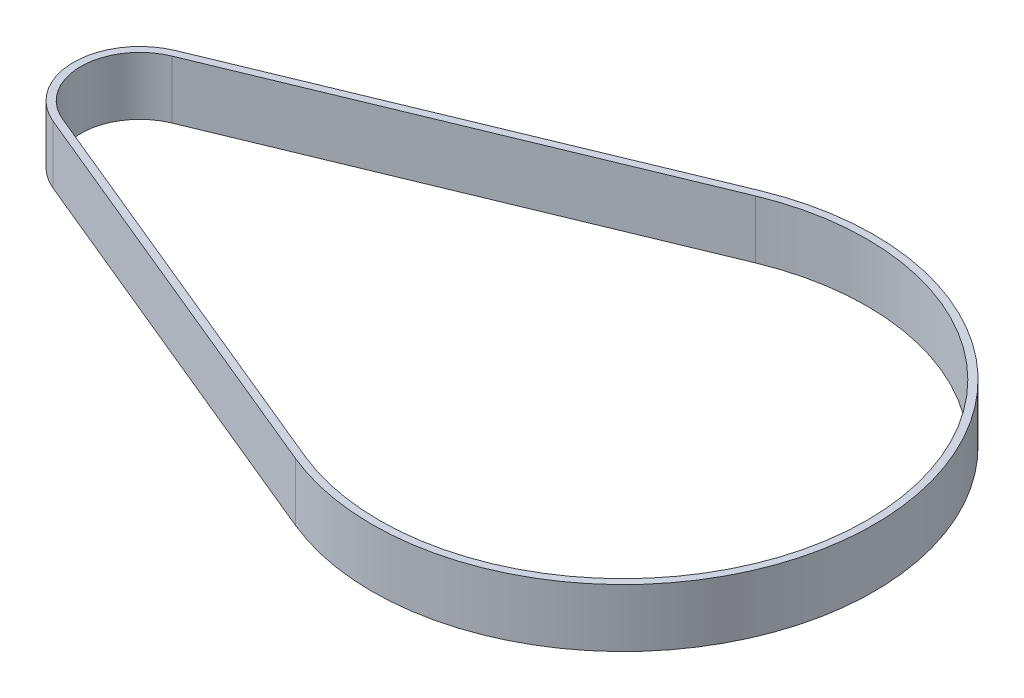
ISO-10303-21;
HEADER;
FILE_DESCRIPTION(('STEP AP214'),'2;1');
FILE_NAME('part.step','',(''),(''),'','','');
FILE_SCHEMA(('AUTOMOTIVE_DESIGN { 1 0 10303 214 1 1 1 1 }'));
ENDSEC;
DATA;
#1=APPLICATION_CONTEXT('core data for automotive mechanical design processes');
#2=APPLICATION_PROTOCOL_DEFINITION('international standard','automotive_design',2000,#1);
#3=PRODUCT_CONTEXT('',#1,'mechanical');
#4=PRODUCT('Part','Part','',(#3));
#5=PRODUCT_RELATED_PRODUCT_CATEGORY('part','',(#4));
#6=PRODUCT_DEFINITION_FORMATION('','',#4);
#7=PRODUCT_DEFINITION_CONTEXT('part definition',#1,'design');
#8=PRODUCT_DEFINITION('design','',#6,#7);
#9=PRODUCT_DEFINITION_SHAPE('','',#8);
#10=(LENGTH_UNIT() NAMED_UNIT(*) SI_UNIT(.MILLI.,.METRE.));
#11=(NAMED_UNIT(*) PLANE_ANGLE_UNIT() SI_UNIT($,.RADIAN.));
#12=(NAMED_UNIT(*) SI_UNIT($,.STERADIAN.) SOLID_ANGLE_UNIT());
#13=UNCERTAINTY_MEASURE_WITH_UNIT(LENGTH_MEASURE(1.E-05),#10,'distance_accuracy_value','');
#14=(GEOMETRIC_REPRESENTATION_CONTEXT(3) GLOBAL_UNCERTAINTY_ASSIGNED_CONTEXT((#13)) GLOBAL_UNIT_ASSIGNED_CONTEXT((#10,
#11,#12)) REPRESENTATION_CONTEXT('',''));
#15=CARTESIAN_POINT('',(0.,0.,0.));
#16=DIRECTION('',(0.,0.,1.));
#17=DIRECTION('',(1.,0.,0.));
#18=AXIS2_PLACEMENT_3D('',#15,#16,#17);
#19=CARTESIAN_POINT('',(20.4845155415814,1.62832630382703,49.5576759839291));
#20=DIRECTION('',(-0.381999745813539,0.,-0.924162428471528));
#21=DIRECTION('',(-0.924162428471528,0.,0.381999745813539));
#22=AXIS2_PLACEMENT_3D('',#19,#20,#21);
#23=PLANE('',#22);
#24=DIRECTION('',(-0.924162428471528,0.,0.381999745813539));
#25=VECTOR('',#24,1.);
#26=CARTESIAN_POINT('',(20.4845155415814,7.62832630382703,49.5576759839291));
#27=LINE('',#26,#25);
#28=CARTESIAN_POINT('',(81.9235839867051,7.62832630382713,24.162022789204));
#29=VERTEX_POINT('',#28);
#30=CARTESIAN_POINT('',(39.1962228672542,7.62832630382706,41.8232483314588));
#31=VERTEX_POINT('',#30);
#32=EDGE_CURVE('E140',#29,#31,#27,.T.);
#33=ORIENTED_EDGE('',*,*,#32,.F.);
#34=DIRECTION('',(0.,1.,0.));
#35=VECTOR('',#34,1.);
#36=CARTESIAN_POINT('',(81.9235839867051,1.62832630382713,24.162022789204));
#37=LINE('',#36,#35);
#38=CARTESIAN_POINT('',(81.9235839867051,1.62832630382713,24.162022789204));
#39=VERTEX_POINT('',#38);
#40=EDGE_CURVE('E11',#39,#29,#37,.T.);
#41=ORIENTED_EDGE('',*,*,#40,.F.);
#42=DIRECTION('',(-0.924162428471528,0.,0.381999745813539));
#43=VECTOR('',#42,1.);
#44=CARTESIAN_POINT('',(20.4845155415814,1.62832630382703,49.5576759839291));
#45=LINE('',#44,#43);
#46=CARTESIAN_POINT('',(39.1962228672542,1.62832630382706,41.8232483314588));
#47=VERTEX_POINT('',#46);
#48=EDGE_CURVE('E111',#39,#47,#45,.T.);
#49=ORIENTED_EDGE('',*,*,#48,.T.);
#50=DIRECTION('',(0.,1.,0.));
#51=VECTOR('',#50,1.);
#52=CARTESIAN_POINT('',(39.1962228672542,1.62832630382706,41.8232483314588));
#53=LINE('',#52,#51);
#54=EDGE_CURVE('E85',#47,#31,#53,.T.);
#55=ORIENTED_EDGE('',*,*,#54,.T.);
#56=EDGE_LOOP('',(#33,#41,#49,#55));
#57=FACE_BOUND('',#56,.T.);
#58=ADVANCED_FACE('F32',(#57),#23,.T.);
#59=CARTESIAN_POINT('',(91.8165498268542,1.62832630382704,48.1630816592964));
#60=DIRECTION('',(0.,1.,0.));
#61=DIRECTION('',(0.,0.,1.));
#62=AXIS2_PLACEMENT_3D('',#59,#60,#61);
#63=CYLINDRICAL_SURFACE('',#62,25.96);
#64=CARTESIAN_POINT('',(91.8165498268542,7.62832630382704,48.1630816592964));
#65=DIRECTION('',(0.,-1.,0.));
#66=DIRECTION('',(0.,0.,-1.));
#67=AXIS2_PLACEMENT_3D('',#64,#65,#66);
#68=CIRCLE('',#67,25.96);
#69=CARTESIAN_POINT('',(81.9235839867109,7.62832630382695,72.1641405293912));
#70=VERTEX_POINT('',#69);
#71=EDGE_CURVE('E117',#29,#70,#68,.T.);
#72=ORIENTED_EDGE('',*,*,#71,.T.);
#73=DIRECTION('',(0.,1.,0.));
#74=VECTOR('',#73,1.);
#75=CARTESIAN_POINT('',(81.9235839867109,1.62832630382695,72.1641405293912));
#76=LINE('',#75,#74);
#77=CARTESIAN_POINT('',(81.9235839867109,1.62832630382695,72.1641405293912));
#78=VERTEX_POINT('',#77);
#79=EDGE_CURVE('E42',#78,#70,#76,.T.);
#80=ORIENTED_EDGE('',*,*,#79,.F.);
#81=CARTESIAN_POINT('',(91.8165498268542,1.62832630382704,48.1630816592964));
#82=DIRECTION('',(0.,-1.,0.));
#83=DIRECTION('',(0.,0.,-1.));
#84=AXIS2_PLACEMENT_3D('',#81,#82,#83);
#85=CIRCLE('',#84,25.96);
#86=EDGE_CURVE('E106',#39,#78,#85,.T.);
#87=ORIENTED_EDGE('',*,*,#86,.F.);
#88=ORIENTED_EDGE('',*,*,#40,.T.);
#89=EDGE_LOOP('',(#72,#80,#87,#88));
#90=FACE_BOUND('',#89,.T.);
#91=ADVANCED_FACE('F115',(#90),#63,.T.);
#92=CARTESIAN_POINT('',(-13.5214918593019,1.62832630382709,32.7122069849591));
#93=DIRECTION('',(-0.381999745813439,0.,0.924162428471569));
#94=DIRECTION('',(0.924162428471569,0.,0.381999745813439));
#95=AXIS2_PLACEMENT_3D('',#92,#93,#94);
#96=PLANE('',#95);
#97=DIRECTION('',(0.924162428471569,0.,0.381999745813439));
#98=VECTOR('',#97,1.);
#99=CARTESIAN_POINT('',(-13.5214918593019,7.62832630382709,32.7122069849592));
#100=LINE('',#99,#98);
#101=CARTESIAN_POINT('',(39.1962228672542,7.62832630382702,54.5029149871395));
#102=VERTEX_POINT('',#101);
#103=EDGE_CURVE('E144',#102,#70,#100,.T.);
#104=ORIENTED_EDGE('',*,*,#103,.F.);
#105=DIRECTION('',(0.,1.,0.));
#106=VECTOR('',#105,1.);
#107=CARTESIAN_POINT('',(39.1962228672542,1.62832630382702,54.5029149871395));
#108=LINE('',#107,#106);
#109=CARTESIAN_POINT('',(39.1962228672542,1.62832630382702,54.5029149871395));
#110=VERTEX_POINT('',#109);
#111=EDGE_CURVE('E78',#110,#102,#108,.T.);
#112=ORIENTED_EDGE('',*,*,#111,.F.);
#113=DIRECTION('',(0.924162428471569,0.,0.381999745813439));
#114=VECTOR('',#113,1.);
#115=CARTESIAN_POINT('',(-13.5214918593019,1.62832630382709,32.7122069849591));
#116=LINE('',#115,#114);
#117=EDGE_CURVE('E110',#110,#78,#116,.T.);
#118=ORIENTED_EDGE('',*,*,#117,.T.);
#119=ORIENTED_EDGE('',*,*,#79,.T.);
#120=EDGE_LOOP('',(#104,#112,#118,#119));
#121=FACE_BOUND('',#120,.T.);
#122=ADVANCED_FACE('F122',(#121),#96,.T.);
#123=CARTESIAN_POINT('',(41.8165498268538,1.62832630382704,48.1630816592991));
#124=DIRECTION('',(0.,1.,0.));
#125=DIRECTION('',(0.,0.,1.));
#126=AXIS2_PLACEMENT_3D('',#123,#124,#125);
#127=CYLINDRICAL_SURFACE('',#126,6.112198);
#128=CARTESIAN_POINT('',(41.8165498268538,7.62832630382704,48.1630816592991));
#129=DIRECTION('',(0.,-1.,0.));
#130=DIRECTION('',(0.,0.,-1.));
#131=AXIS2_PLACEMENT_3D('',#128,#129,#130);
#132=CIRCLE('',#131,6.112198);
#133=CARTESIAN_POINT('',(39.4818621881059,7.62832630382702,53.8118158556197));
#134=VERTEX_POINT('',#133);
#135=CARTESIAN_POINT('',(39.4818621881053,7.62832630382706,42.5143474629788));
#136=VERTEX_POINT('',#135);
#137=EDGE_CURVE('E128',#134,#136,#132,.T.);
#138=ORIENTED_EDGE('',*,*,#137,.F.);
#139=DIRECTION('',(0.,1.,0.));
#140=VECTOR('',#139,1.);
#141=CARTESIAN_POINT('',(39.4818621881059,1.62832630382702,53.8118158556197));
#142=LINE('',#141,#140);
#143=CARTESIAN_POINT('',(39.4818621881059,1.62832630382702,53.8118158556197));
#144=VERTEX_POINT('',#143);
#145=EDGE_CURVE('E36',#144,#134,#142,.T.);
#146=ORIENTED_EDGE('',*,*,#145,.F.);
#147=CARTESIAN_POINT('',(41.8165498268538,1.62832630382704,48.1630816592991));
#148=DIRECTION('',(0.,-1.,0.));
#149=DIRECTION('',(0.,0.,-1.));
#150=AXIS2_PLACEMENT_3D('',#147,#148,#149);
#151=CIRCLE('',#150,6.112198);
#152=CARTESIAN_POINT('',(39.4818621881053,1.62832630382706,42.5143474629788));
#153=VERTEX_POINT('',#152);
#154=EDGE_CURVE('E148',#144,#153,#151,.T.);
#155=ORIENTED_EDGE('',*,*,#154,.T.);
#156=DIRECTION('',(0.,1.,0.));
#157=VECTOR('',#156,1.);
#158=CARTESIAN_POINT('',(39.4818621881053,1.62832630382706,42.5143474629788));
#159=LINE('',#158,#157);
#160=EDGE_CURVE('E124',#153,#136,#159,.T.);
#161=ORIENTED_EDGE('',*,*,#160,.T.);
#162=EDGE_LOOP('',(#138,#146,#155,#161));
#163=FACE_BOUND('',#162,.T.);
#164=ADVANCED_FACE('F34',(#163),#127,.F.);
#165=CARTESIAN_POINT('',(-13.2355229332748,1.6283263038271,32.0231065426248));
#166=DIRECTION('',(0.381971859999947,0.,-0.924173954495679));
#167=DIRECTION('',(-0.924173954495679,0.,-0.381971859999947));
#168=AXIS2_PLACEMENT_3D('',#165,#166,#167);
#169=PLANE('',#168);
#170=DIRECTION('',(-0.924173954495679,0.,-0.381971859999947));
#171=VECTOR('',#170,1.);
#172=CARTESIAN_POINT('',(-13.2355229332748,7.6283263038271,32.0231065426248));
#173=LINE('',#172,#171);
#174=CARTESIAN_POINT('',(82.1867370965143,7.62832630382696,71.4622380737305));
#175=VERTEX_POINT('',#174);
#176=EDGE_CURVE('E131',#175,#134,#173,.T.);
#177=ORIENTED_EDGE('',*,*,#176,.F.);
#178=DIRECTION('',(0.,1.,0.));
#179=VECTOR('',#178,1.);
#180=CARTESIAN_POINT('',(82.1867370965143,1.62832630382696,71.4622380737305));
#181=LINE('',#180,#179);
#182=CARTESIAN_POINT('',(82.1867370965143,1.62832630382696,71.4622380737305));
#183=VERTEX_POINT('',#182);
#184=EDGE_CURVE('E153',#183,#175,#181,.T.);
#185=ORIENTED_EDGE('',*,*,#184,.F.);
#186=DIRECTION('',(-0.924173954495679,0.,-0.381971859999947));
#187=VECTOR('',#186,1.);
#188=CARTESIAN_POINT('',(-13.2355229332748,1.6283263038271,32.0231065426248));
#189=LINE('',#188,#187);
#190=EDGE_CURVE('E162',#183,#144,#189,.T.);
#191=ORIENTED_EDGE('',*,*,#190,.T.);
#192=ORIENTED_EDGE('',*,*,#145,.T.);
#193=EDGE_LOOP('',(#177,#185,#191,#192));
#194=FACE_BOUND('',#193,.T.);
#195=ADVANCED_FACE('F160',(#194),#169,.T.);
#196=CARTESIAN_POINT('',(91.8165498268542,1.62832630382704,48.1630816592964));
#197=DIRECTION('',(0.,1.,0.));
#198=DIRECTION('',(0.,0.,1.));
#199=AXIS2_PLACEMENT_3D('',#196,#197,#198);
#200=CYLINDRICAL_SURFACE('',#199,25.210791);
#201=CARTESIAN_POINT('',(91.8165498268542,7.62832630382704,48.1630816592964));
#202=DIRECTION('',(0.,-1.,0.));
#203=DIRECTION('',(0.,0.,-1.));
#204=AXIS2_PLACEMENT_3D('',#201,#202,#203);
#205=CIRCLE('',#204,25.210791);
#206=CARTESIAN_POINT('',(82.1867370965118,7.62832630382712,24.8639252448634));
#207=VERTEX_POINT('',#206);
#208=EDGE_CURVE('E134',#207,#175,#205,.T.);
#209=ORIENTED_EDGE('',*,*,#208,.F.);
#210=DIRECTION('',(0.,1.,0.));
#211=VECTOR('',#210,1.);
#212=CARTESIAN_POINT('',(82.1867370965118,1.62832630382712,24.8639252448634));
#213=LINE('',#212,#211);
#214=CARTESIAN_POINT('',(82.1867370965118,1.62832630382712,24.8639252448634));
#215=VERTEX_POINT('',#214);
#216=EDGE_CURVE('E152',#215,#207,#213,.T.);
#217=ORIENTED_EDGE('',*,*,#216,.F.);
#218=CARTESIAN_POINT('',(91.8165498268542,1.62832630382704,48.1630816592964));
#219=DIRECTION('',(0.,-1.,0.));
#220=DIRECTION('',(0.,0.,-1.));
#221=AXIS2_PLACEMENT_3D('',#218,#219,#220);
#222=CIRCLE('',#221,25.210791);
#223=EDGE_CURVE('E169',#215,#183,#222,.T.);
#224=ORIENTED_EDGE('',*,*,#223,.T.);
#225=ORIENTED_EDGE('',*,*,#184,.T.);
#226=EDGE_LOOP('',(#209,#217,#224,#225));
#227=FACE_BOUND('',#226,.T.);
#228=ADVANCED_FACE('F167',(#227),#200,.F.);
#229=CARTESIAN_POINT('',(20.768426131211,1.62832630382703,50.2488285559293));
#230=DIRECTION('',(0.381971860000047,0.,0.924173954495638));
#231=DIRECTION('',(0.924173954495638,0.,-0.381971860000047));
#232=AXIS2_PLACEMENT_3D('',#229,#230,#231);
#233=PLANE('',#232);
#234=DIRECTION('',(0.924173954495638,0.,-0.381971860000047));
#235=VECTOR('',#234,1.);
#236=CARTESIAN_POINT('',(20.768426131211,7.62832630382703,50.2488285559293));
#237=LINE('',#236,#235);
#238=EDGE_CURVE('E137',#136,#207,#237,.T.);
#239=ORIENTED_EDGE('',*,*,#238,.F.);
#240=ORIENTED_EDGE('',*,*,#160,.F.);
#241=DIRECTION('',(0.924173954495638,0.,-0.381971860000047));
#242=VECTOR('',#241,1.);
#243=CARTESIAN_POINT('',(20.768426131211,1.62832630382703,50.2488285559293));
#244=LINE('',#243,#242);
#245=EDGE_CURVE('E174',#153,#215,#244,.T.);
#246=ORIENTED_EDGE('',*,*,#245,.T.);
#247=ORIENTED_EDGE('',*,*,#216,.T.);
#248=EDGE_LOOP('',(#239,#240,#246,#247));
#249=FACE_BOUND('',#248,.T.);
#250=ADVANCED_FACE('F176',(#249),#233,.T.);
#251=CARTESIAN_POINT('',(41.8165498268538,1.62832630382704,48.1630816592991));
#252=DIRECTION('',(0.,1.,0.));
#253=DIRECTION('',(0.,0.,1.));
#254=AXIS2_PLACEMENT_3D('',#251,#252,#253);
#255=CYLINDRICAL_SURFACE('',#254,6.86);
#256=CARTESIAN_POINT('',(41.8165498268538,7.62832630382704,48.1630816592991));
#257=DIRECTION('',(0.,-1.,0.));
#258=DIRECTION('',(0.,0.,-1.));
#259=AXIS2_PLACEMENT_3D('',#256,#257,#258);
#260=CIRCLE('',#259,6.86);
#261=EDGE_CURVE('E146',#102,#31,#260,.T.);
#262=ORIENTED_EDGE('',*,*,#261,.T.);
#263=ORIENTED_EDGE('',*,*,#54,.F.);
#264=CARTESIAN_POINT('',(41.8165498268538,1.62832630382704,48.1630816592991));
#265=DIRECTION('',(0.,-1.,0.));
#266=DIRECTION('',(0.,0.,-1.));
#267=AXIS2_PLACEMENT_3D('',#264,#265,#266);
#268=CIRCLE('',#267,6.86);
#269=EDGE_CURVE('E51',#110,#47,#268,.T.);
#270=ORIENTED_EDGE('',*,*,#269,.F.);
#271=ORIENTED_EDGE('',*,*,#111,.T.);
#272=EDGE_LOOP('',(#262,#263,#270,#271));
#273=FACE_BOUND('',#272,.T.);
#274=ADVANCED_FACE('F180',(#273),#255,.T.);
#275=CARTESIAN_POINT('',(0.,1.62832630382721,0.));
#276=DIRECTION('',(0.,-1.,0.));
#277=DIRECTION('',(0.,0.,-1.));
#278=AXIS2_PLACEMENT_3D('',#275,#276,#277);
#279=PLANE('',#278);
#280=ORIENTED_EDGE('',*,*,#154,.F.);
#281=ORIENTED_EDGE('',*,*,#190,.F.);
#282=ORIENTED_EDGE('',*,*,#223,.F.);
#283=ORIENTED_EDGE('',*,*,#245,.F.);
#284=EDGE_LOOP('',(#280,#281,#282,#283));
#285=FACE_BOUND('',#284,.T.);
#286=ORIENTED_EDGE('',*,*,#48,.F.);
#287=ORIENTED_EDGE('',*,*,#86,.T.);
#288=ORIENTED_EDGE('',*,*,#117,.F.);
#289=ORIENTED_EDGE('',*,*,#269,.T.);
#290=EDGE_LOOP('',(#286,#287,#288,#289));
#291=FACE_BOUND('',#290,.T.);
#292=ADVANCED_FACE('F108',(#285,#291),#279,.T.);
#293=CARTESIAN_POINT('',(0.,7.62832630382721,0.));
#294=DIRECTION('',(0.,-1.,0.));
#295=DIRECTION('',(0.,0.,-1.));
#296=AXIS2_PLACEMENT_3D('',#293,#294,#295);
#297=PLANE('',#296);
#298=ORIENTED_EDGE('',*,*,#137,.T.);
#299=ORIENTED_EDGE('',*,*,#238,.T.);
#300=ORIENTED_EDGE('',*,*,#208,.T.);
#301=ORIENTED_EDGE('',*,*,#176,.T.);
#302=EDGE_LOOP('',(#298,#299,#300,#301));
#303=FACE_BOUND('',#302,.T.);
#304=ORIENTED_EDGE('',*,*,#32,.T.);
#305=ORIENTED_EDGE('',*,*,#261,.F.);
#306=ORIENTED_EDGE('',*,*,#103,.T.);
#307=ORIENTED_EDGE('',*,*,#71,.F.);
#308=EDGE_LOOP('',(#304,#305,#306,#307));
#309=FACE_BOUND('',#308,.T.);
#310=ADVANCED_FACE('F165',(#303,#309),#297,.F.);
#311=CLOSED_SHELL('',(#58,#91,#122,#164,#195,#228,#250,#274,#292,#310));
#312=MANIFOLD_SOLID_BREP('B2',#311);
#313=ADVANCED_BREP_SHAPE_REPRESENTATION('',(#18,#312),#14);
#314=SHAPE_DEFINITION_REPRESENTATION(#9,#313);
ENDSEC;
END-ISO-10303-21;
